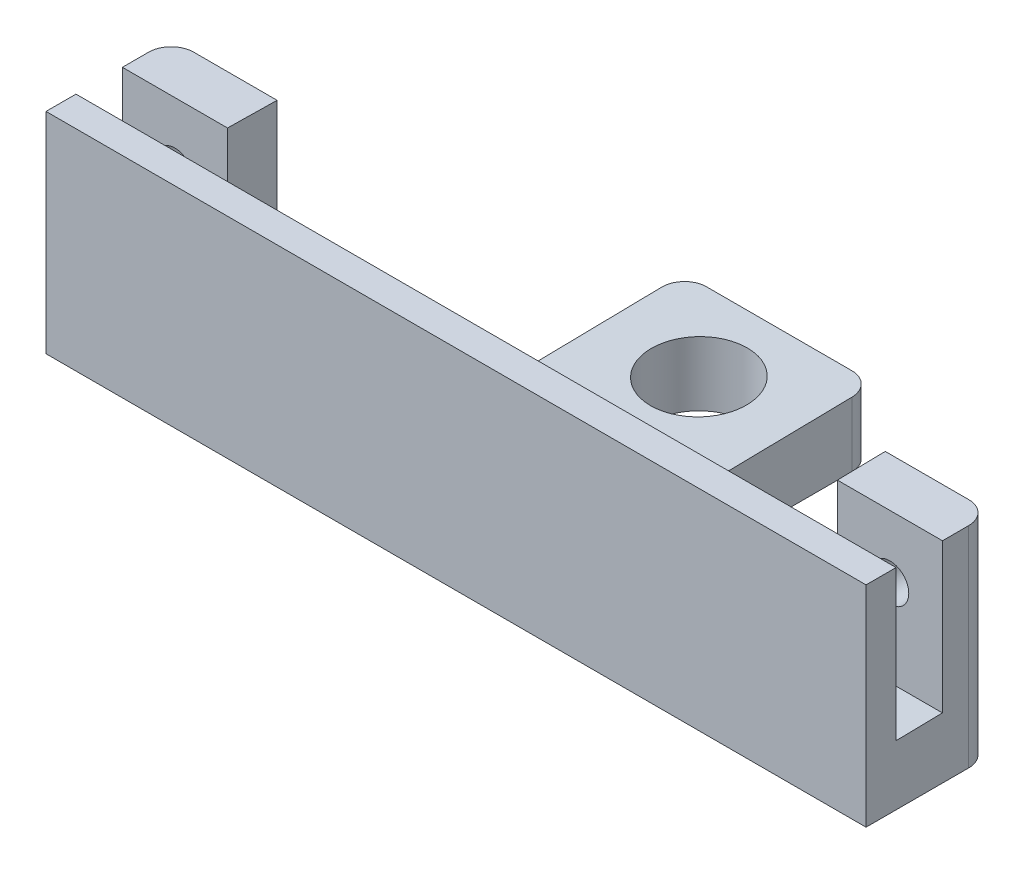
ISO-10303-21;
HEADER;
FILE_DESCRIPTION(('STEP AP214'),'2;1');
FILE_NAME('part.step','',(''),(''),'','','');
FILE_SCHEMA(('AUTOMOTIVE_DESIGN { 1 0 10303 214 1 1 1 1 }'));
ENDSEC;
DATA;
#1=APPLICATION_CONTEXT('core data for automotive mechanical design processes');
#2=APPLICATION_PROTOCOL_DEFINITION('international standard','automotive_design',2000,#1);
#3=PRODUCT_CONTEXT('',#1,'mechanical');
#4=PRODUCT('Part','Part','',(#3));
#5=PRODUCT_RELATED_PRODUCT_CATEGORY('part','',(#4));
#6=PRODUCT_DEFINITION_FORMATION('','',#4);
#7=PRODUCT_DEFINITION_CONTEXT('part definition',#1,'design');
#8=PRODUCT_DEFINITION('design','',#6,#7);
#9=PRODUCT_DEFINITION_SHAPE('','',#8);
#10=(LENGTH_UNIT() NAMED_UNIT(*) SI_UNIT(.MILLI.,.METRE.));
#11=(NAMED_UNIT(*) PLANE_ANGLE_UNIT() SI_UNIT($,.RADIAN.));
#12=(NAMED_UNIT(*) SI_UNIT($,.STERADIAN.) SOLID_ANGLE_UNIT());
#13=UNCERTAINTY_MEASURE_WITH_UNIT(LENGTH_MEASURE(1.E-05),#10,'distance_accuracy_value','');
#14=(GEOMETRIC_REPRESENTATION_CONTEXT(3) GLOBAL_UNCERTAINTY_ASSIGNED_CONTEXT((#13)) GLOBAL_UNIT_ASSIGNED_CONTEXT((#10,
#11,#12)) REPRESENTATION_CONTEXT('',''));
#15=CARTESIAN_POINT('',(0.,0.,0.));
#16=DIRECTION('',(0.,0.,1.));
#17=DIRECTION('',(1.,0.,0.));
#18=AXIS2_PLACEMENT_3D('',#15,#16,#17);
#19=CARTESIAN_POINT('',(14.0189,28.,-6.1944));
#20=DIRECTION('',(0.,0.,-1.));
#21=DIRECTION('',(-1.,0.,0.));
#22=AXIS2_PLACEMENT_3D('',#19,#20,#21);
#23=PLANE('',#22);
#24=CARTESIAN_POINT('',(6.9977,19.67,-6.1944));
#25=DIRECTION('',(0.,0.,1.));
#26=DIRECTION('',(1.,0.,0.));
#27=AXIS2_PLACEMENT_3D('',#24,#25,#26);
#28=CIRCLE('',#27,2.5019);
#29=CARTESIAN_POINT('',(9.4996,19.67,-6.1944));
#30=VERTEX_POINT('',#29);
#31=EDGE_CURVE('E272',#30,#30,#28,.T.);
#32=ORIENTED_EDGE('',*,*,#31,.F.);
#33=EDGE_LOOP('',(#32));
#34=FACE_BOUND('',#33,.T.);
#35=DIRECTION('',(1.,0.,0.));
#36=VECTOR('',#35,1.);
#37=CARTESIAN_POINT('',(0.,8.10812365419131,-6.1944));
#38=LINE('',#37,#36);
#39=CARTESIAN_POINT('',(0.,8.10812365419131,-6.1944));
#40=VERTEX_POINT('',#39);
#41=CARTESIAN_POINT('',(14.0189,8.10812365419131,-6.1944));
#42=VERTEX_POINT('',#41);
#43=EDGE_CURVE('E52',#40,#42,#38,.T.);
#44=ORIENTED_EDGE('',*,*,#43,.T.);
#45=DIRECTION('',(0.,-1.,0.));
#46=VECTOR('',#45,1.);
#47=CARTESIAN_POINT('',(14.0189,28.,-6.1944));
#48=LINE('',#47,#46);
#49=CARTESIAN_POINT('',(14.0189,28.,-6.1944));
#50=VERTEX_POINT('',#49);
#51=EDGE_CURVE('E313',#50,#42,#48,.T.);
#52=ORIENTED_EDGE('',*,*,#51,.F.);
#53=DIRECTION('',(1.,0.,0.));
#54=VECTOR('',#53,1.);
#55=CARTESIAN_POINT('',(14.0189,28.,-6.1944));
#56=LINE('',#55,#54);
#57=CARTESIAN_POINT('',(0.,28.,-6.1944));
#58=VERTEX_POINT('',#57);
#59=EDGE_CURVE('E306',#58,#50,#56,.T.);
#60=ORIENTED_EDGE('',*,*,#59,.F.);
#61=DIRECTION('',(0.,-1.,0.));
#62=VECTOR('',#61,1.);
#63=CARTESIAN_POINT('',(0.,28.,-6.1944));
#64=LINE('',#63,#62);
#65=EDGE_CURVE('E48',#58,#40,#64,.T.);
#66=ORIENTED_EDGE('',*,*,#65,.T.);
#67=EDGE_LOOP('',(#44,#52,#60,#66));
#68=FACE_BOUND('',#67,.T.);
#69=ADVANCED_FACE('F33',(#34,#68),#23,.F.);
#70=CARTESIAN_POINT('',(14.1324556703971,28.,-12.7));
#71=DIRECTION('',(-0.999847695156391,0.,-0.0174524064372938));
#72=DIRECTION('',(-0.0174524064372938,0.,0.999847695156391));
#73=AXIS2_PLACEMENT_3D('',#70,#71,#72);
#74=PLANE('',#73);
#75=DIRECTION('',(0.017449749160693,0.0174497491606759,-0.999695459881887));
#76=VECTOR('',#75,1.);
#77=CARTESIAN_POINT('',(14.0543499983098,8.14357365250105,-8.22532904297698));
#78=LINE('',#77,#76);
#79=CARTESIAN_POINT('',(14.1324556703971,8.22167932458828,-12.7));
#80=VERTEX_POINT('',#79);
#81=EDGE_CURVE('E220',#42,#80,#78,.T.);
#82=ORIENTED_EDGE('',*,*,#81,.T.);
#83=DIRECTION('',(0.,-1.,0.));
#84=VECTOR('',#83,1.);
#85=CARTESIAN_POINT('',(14.1324556703971,28.,-12.7));
#86=LINE('',#85,#84);
#87=CARTESIAN_POINT('',(14.1324556703971,28.,-12.7));
#88=VERTEX_POINT('',#87);
#89=EDGE_CURVE('E310',#88,#80,#86,.T.);
#90=ORIENTED_EDGE('',*,*,#89,.F.);
#91=DIRECTION('',(0.0174524064372938,0.,-0.999847695156391));
#92=VECTOR('',#91,1.);
#93=CARTESIAN_POINT('',(14.1324556703971,28.,-12.7));
#94=LINE('',#93,#92);
#95=EDGE_CURVE('E308',#50,#88,#94,.T.);
#96=ORIENTED_EDGE('',*,*,#95,.F.);
#97=ORIENTED_EDGE('',*,*,#51,.T.);
#98=EDGE_LOOP('',(#82,#90,#96,#97));
#99=FACE_BOUND('',#98,.T.);
#100=ADVANCED_FACE('F395',(#99),#74,.F.);
#101=CARTESIAN_POINT('',(95.3789,28.,-6.19440000000001));
#102=DIRECTION('',(0.,0.,-1.));
#103=DIRECTION('',(-1.,0.,0.));
#104=AXIS2_PLACEMENT_3D('',#101,#102,#103);
#105=PLANE('',#104);
#106=CARTESIAN_POINT('',(102.4001,19.67,-6.1944));
#107=DIRECTION('',(0.,0.,1.));
#108=DIRECTION('',(-1.,0.,0.));
#109=AXIS2_PLACEMENT_3D('',#106,#107,#108);
#110=CIRCLE('',#109,2.50190000000002);
#111=CARTESIAN_POINT('',(104.902,19.67,-6.1944));
#112=VERTEX_POINT('',#111);
#113=EDGE_CURVE('E271',#112,#112,#110,.T.);
#114=ORIENTED_EDGE('',*,*,#113,.F.);
#115=EDGE_LOOP('',(#114));
#116=FACE_BOUND('',#115,.T.);
#117=DIRECTION('',(1.,0.,0.));
#118=VECTOR('',#117,1.);
#119=CARTESIAN_POINT('',(95.3789,8.10812365419131,-6.19440000000001));
#120=LINE('',#119,#118);
#121=CARTESIAN_POINT('',(95.3789,8.10812365419131,-6.19440000000001));
#122=VERTEX_POINT('',#121);
#123=CARTESIAN_POINT('',(109.3978,8.10812365419131,-6.19440000000001));
#124=VERTEX_POINT('',#123);
#125=EDGE_CURVE('E211',#122,#124,#120,.T.);
#126=ORIENTED_EDGE('',*,*,#125,.T.);
#127=DIRECTION('',(0.,-1.,0.));
#128=VECTOR('',#127,1.);
#129=CARTESIAN_POINT('',(109.3978,28.,-6.19440000000001));
#130=LINE('',#129,#128);
#131=CARTESIAN_POINT('',(109.3978,28.,-6.19440000000001));
#132=VERTEX_POINT('',#131);
#133=EDGE_CURVE('E298',#132,#124,#130,.T.);
#134=ORIENTED_EDGE('',*,*,#133,.F.);
#135=DIRECTION('',(1.,0.,0.));
#136=VECTOR('',#135,1.);
#137=CARTESIAN_POINT('',(95.3789,28.,-6.19440000000001));
#138=LINE('',#137,#136);
#139=CARTESIAN_POINT('',(95.3789,28.,-6.19440000000001));
#140=VERTEX_POINT('',#139);
#141=EDGE_CURVE('E279',#140,#132,#138,.T.);
#142=ORIENTED_EDGE('',*,*,#141,.F.);
#143=DIRECTION('',(0.,-1.,0.));
#144=VECTOR('',#143,1.);
#145=CARTESIAN_POINT('',(95.3789,28.,-6.19440000000001));
#146=LINE('',#145,#144);
#147=EDGE_CURVE('E293',#140,#122,#146,.T.);
#148=ORIENTED_EDGE('',*,*,#147,.T.);
#149=EDGE_LOOP('',(#126,#134,#142,#148));
#150=FACE_BOUND('',#149,.T.);
#151=ADVANCED_FACE('F412',(#116,#150),#105,.F.);
#152=CARTESIAN_POINT('',(95.2653443296029,28.,-12.7));
#153=DIRECTION('',(0.999847695156391,0.,-0.0174524064372949));
#154=DIRECTION('',(-0.0174524064372949,0.,-0.999847695156391));
#155=AXIS2_PLACEMENT_3D('',#152,#153,#154);
#156=PLANE('',#155);
#157=DIRECTION('',(0.0174497491606962,-0.0174497491606759,0.999695459881887));
#158=VECTOR('',#157,1.);
#159=CARTESIAN_POINT('',(95.2299289082845,8.25709474590659,-14.7289481284645));
#160=LINE('',#159,#158);
#161=CARTESIAN_POINT('',(95.2653443296029,8.22167932458828,-12.7));
#162=VERTEX_POINT('',#161);
#163=EDGE_CURVE('E209',#162,#122,#160,.T.);
#164=ORIENTED_EDGE('',*,*,#163,.T.);
#165=ORIENTED_EDGE('',*,*,#147,.F.);
#166=DIRECTION('',(0.0174524064372949,0.,0.999847695156391));
#167=VECTOR('',#166,1.);
#168=CARTESIAN_POINT('',(95.2653443296029,28.,-12.7));
#169=LINE('',#168,#167);
#170=CARTESIAN_POINT('',(95.2653443296029,28.,-12.7));
#171=VERTEX_POINT('',#170);
#172=EDGE_CURVE('E291',#171,#140,#169,.T.);
#173=ORIENTED_EDGE('',*,*,#172,.F.);
#174=DIRECTION('',(0.,-1.,0.));
#175=VECTOR('',#174,1.);
#176=CARTESIAN_POINT('',(95.2653443296029,28.,-12.7));
#177=LINE('',#176,#175);
#178=EDGE_CURVE('E296',#171,#162,#177,.T.);
#179=ORIENTED_EDGE('',*,*,#178,.T.);
#180=EDGE_LOOP('',(#164,#165,#173,#179));
#181=FACE_BOUND('',#180,.T.);
#182=ADVANCED_FACE('F471',(#181),#156,.F.);
#183=CARTESIAN_POINT('',(67.3989,8.,-39.116));
#184=DIRECTION('',(-1.,0.,0.));
#185=DIRECTION('',(0.,0.,1.));
#186=AXIS2_PLACEMENT_3D('',#183,#184,#185);
#187=PLANE('',#186);
#188=DIRECTION('',(0.,-1.,0.));
#189=VECTOR('',#188,1.);
#190=CARTESIAN_POINT('',(67.3989,8.,-36.116));
#191=LINE('',#190,#189);
#192=CARTESIAN_POINT('',(67.3989,0.,-36.116));
#193=VERTEX_POINT('',#192);
#194=CARTESIAN_POINT('',(67.3989,8.63040712494726,-36.116));
#195=VERTEX_POINT('',#194);
#196=EDGE_CURVE('E205',#193,#195,#191,.F.);
#197=ORIENTED_EDGE('',*,*,#196,.T.);
#198=DIRECTION('',(0.,-0.0174524064372768,0.999847695156391));
#199=VECTOR('',#198,1.);
#200=CARTESIAN_POINT('',(67.3989,8.36180402307295,-20.7277385997116));
#201=LINE('',#200,#199);
#202=CARTESIAN_POINT('',(67.3989,8.32640971415756,-18.7));
#203=VERTEX_POINT('',#202);
#204=EDGE_CURVE('E197',#195,#203,#201,.T.);
#205=ORIENTED_EDGE('',*,*,#204,.T.);
#206=DIRECTION('',(0.,-1.,0.));
#207=VECTOR('',#206,1.);
#208=CARTESIAN_POINT('',(67.3989,0.,-18.7));
#209=LINE('',#208,#207);
#210=CARTESIAN_POINT('',(67.3989,0.,-18.7));
#211=VERTEX_POINT('',#210);
#212=EDGE_CURVE('E181',#203,#211,#209,.T.);
#213=ORIENTED_EDGE('',*,*,#212,.T.);
#214=DIRECTION('',(0.,0.,-1.));
#215=VECTOR('',#214,1.);
#216=CARTESIAN_POINT('',(67.3989,0.,-39.116));
#217=LINE('',#216,#215);
#218=EDGE_CURVE('E316',#211,#193,#217,.T.);
#219=ORIENTED_EDGE('',*,*,#218,.T.);
#220=EDGE_LOOP('',(#197,#205,#213,#219));
#221=FACE_BOUND('',#220,.T.);
#222=ADVANCED_FACE('F203',(#221),#187,.F.);
#223=CARTESIAN_POINT('',(41.9989,8.,-39.116));
#224=DIRECTION('',(0.,0.,1.));
#225=DIRECTION('',(1.,0.,0.));
#226=AXIS2_PLACEMENT_3D('',#223,#224,#225);
#227=PLANE('',#226);
#228=DIRECTION('',(-1.,0.,0.));
#229=VECTOR('',#228,1.);
#230=CARTESIAN_POINT('',(41.9989,0.,-39.116));
#231=LINE('',#230,#229);
#232=CARTESIAN_POINT('',(64.3989,0.,-39.116));
#233=VERTEX_POINT('',#232);
#234=CARTESIAN_POINT('',(44.9989,0.,-39.116));
#235=VERTEX_POINT('',#234);
#236=EDGE_CURVE('E323',#233,#235,#231,.T.);
#237=ORIENTED_EDGE('',*,*,#236,.T.);
#238=DIRECTION('',(0.,-1.,0.));
#239=VECTOR('',#238,1.);
#240=CARTESIAN_POINT('',(44.9989,8.,-39.116));
#241=LINE('',#240,#239);
#242=CARTESIAN_POINT('',(44.9989,8.6827723197319,-39.116));
#243=VERTEX_POINT('',#242);
#244=EDGE_CURVE('E367',#235,#243,#241,.F.);
#245=ORIENTED_EDGE('',*,*,#244,.T.);
#246=DIRECTION('',(1.,0.,0.));
#247=VECTOR('',#246,1.);
#248=CARTESIAN_POINT('',(64.3989,8.68277231973189,-39.116));
#249=LINE('',#248,#247);
#250=CARTESIAN_POINT('',(64.3989,8.68277231973189,-39.116));
#251=VERTEX_POINT('',#250);
#252=EDGE_CURVE('E234',#243,#251,#249,.T.);
#253=ORIENTED_EDGE('',*,*,#252,.T.);
#254=DIRECTION('',(0.,-1.,0.));
#255=VECTOR('',#254,1.);
#256=CARTESIAN_POINT('',(64.3989,8.,-39.116));
#257=LINE('',#256,#255);
#258=EDGE_CURVE('E364',#251,#233,#257,.T.);
#259=ORIENTED_EDGE('',*,*,#258,.T.);
#260=EDGE_LOOP('',(#237,#245,#253,#259));
#261=FACE_BOUND('',#260,.T.);
#262=ADVANCED_FACE('F427',(#261),#227,.F.);
#263=CARTESIAN_POINT('',(41.9989,8.,-39.116));
#264=DIRECTION('',(1.,0.,0.));
#265=DIRECTION('',(0.,0.,-1.));
#266=AXIS2_PLACEMENT_3D('',#263,#264,#265);
#267=PLANE('',#266);
#268=DIRECTION('',(0.,0.,1.));
#269=VECTOR('',#268,1.);
#270=CARTESIAN_POINT('',(41.9989,0.,-39.116));
#271=LINE('',#270,#269);
#272=CARTESIAN_POINT('',(41.9989,0.,-36.116));
#273=VERTEX_POINT('',#272);
#274=CARTESIAN_POINT('',(41.9989,0.,-18.7));
#275=VERTEX_POINT('',#274);
#276=EDGE_CURVE('E326',#273,#275,#271,.T.);
#277=ORIENTED_EDGE('',*,*,#276,.T.);
#278=DIRECTION('',(0.,-1.,0.));
#279=VECTOR('',#278,1.);
#280=CARTESIAN_POINT('',(41.9989,8.,-18.7));
#281=LINE('',#280,#279);
#282=CARTESIAN_POINT('',(41.9989,8.32640971415755,-18.7));
#283=VERTEX_POINT('',#282);
#284=EDGE_CURVE('E189',#275,#283,#281,.F.);
#285=ORIENTED_EDGE('',*,*,#284,.T.);
#286=DIRECTION('',(0.,0.0174524064372768,-0.999847695156391));
#287=VECTOR('',#286,1.);
#288=CARTESIAN_POINT('',(41.9989,8.66570884035821,-38.1384339213938));
#289=LINE('',#288,#287);
#290=CARTESIAN_POINT('',(41.9989,8.63040712494726,-36.116));
#291=VERTEX_POINT('',#290);
#292=EDGE_CURVE('E228',#283,#291,#289,.T.);
#293=ORIENTED_EDGE('',*,*,#292,.T.);
#294=DIRECTION('',(0.,-1.,0.));
#295=VECTOR('',#294,1.);
#296=CARTESIAN_POINT('',(41.9989,8.,-36.116));
#297=LINE('',#296,#295);
#298=EDGE_CURVE('E361',#291,#273,#297,.T.);
#299=ORIENTED_EDGE('',*,*,#298,.T.);
#300=EDGE_LOOP('',(#277,#285,#293,#299));
#301=FACE_BOUND('',#300,.T.);
#302=ADVANCED_FACE('F382',(#301),#267,.F.);
#303=CARTESIAN_POINT('',(0.,8.,-12.7));
#304=DIRECTION('',(0.,0.,1.));
#305=DIRECTION('',(1.,0.,0.));
#306=AXIS2_PLACEMENT_3D('',#303,#304,#305);
#307=PLANE('',#306);
#308=CARTESIAN_POINT('',(6.9977,19.67,-12.7));
#309=DIRECTION('',(0.,0.,1.));
#310=DIRECTION('',(1.,0.,0.));
#311=AXIS2_PLACEMENT_3D('',#308,#309,#310);
#312=CIRCLE('',#311,2.5019);
#313=CARTESIAN_POINT('',(9.4996,19.67,-12.7));
#314=VERTEX_POINT('',#313);
#315=EDGE_CURVE('E275',#314,#314,#312,.F.);
#316=ORIENTED_EDGE('',*,*,#315,.F.);
#317=EDGE_LOOP('',(#316));
#318=FACE_BOUND('',#317,.T.);
#319=DIRECTION('',(1.,0.,0.));
#320=VECTOR('',#319,1.);
#321=CARTESIAN_POINT('',(35.9989,8.22167932458827,-12.7));
#322=LINE('',#321,#320);
#323=CARTESIAN_POINT('',(35.9989,8.22167932458827,-12.7));
#324=VERTEX_POINT('',#323);
#325=EDGE_CURVE('E222',#80,#324,#322,.T.);
#326=ORIENTED_EDGE('',*,*,#325,.T.);
#327=DIRECTION('',(0.,-1.,0.));
#328=VECTOR('',#327,1.);
#329=CARTESIAN_POINT('',(35.9989,0.,-12.7));
#330=LINE('',#329,#328);
#331=CARTESIAN_POINT('',(35.9989,0.,-12.7));
#332=VERTEX_POINT('',#331);
#333=EDGE_CURVE('E370',#324,#332,#330,.T.);
#334=ORIENTED_EDGE('',*,*,#333,.T.);
#335=DIRECTION('',(-1.,0.,0.));
#336=VECTOR('',#335,1.);
#337=CARTESIAN_POINT('',(0.,0.,-12.7));
#338=LINE('',#337,#336);
#339=CARTESIAN_POINT('',(3.,0.,-12.7));
#340=VERTEX_POINT('',#339);
#341=EDGE_CURVE('E329',#332,#340,#338,.T.);
#342=ORIENTED_EDGE('',*,*,#341,.T.);
#343=DIRECTION('',(0.,-1.,0.));
#344=VECTOR('',#343,1.);
#345=CARTESIAN_POINT('',(3.,8.,-12.7));
#346=LINE('',#345,#344);
#347=CARTESIAN_POINT('',(3.,28.,-12.7));
#348=VERTEX_POINT('',#347);
#349=EDGE_CURVE('E350',#340,#348,#346,.F.);
#350=ORIENTED_EDGE('',*,*,#349,.T.);
#351=DIRECTION('',(-1.,0.,0.));
#352=VECTOR('',#351,1.);
#353=CARTESIAN_POINT('',(0.,28.,-12.7));
#354=LINE('',#353,#352);
#355=EDGE_CURVE('E301',#88,#348,#354,.T.);
#356=ORIENTED_EDGE('',*,*,#355,.F.);
#357=ORIENTED_EDGE('',*,*,#89,.T.);
#358=EDGE_LOOP('',(#326,#334,#342,#350,#356,#357));
#359=FACE_BOUND('',#358,.T.);
#360=ADVANCED_FACE('F390',(#318,#359),#307,.F.);
#361=CARTESIAN_POINT('',(0.,8.,0.));
#362=DIRECTION('',(1.,0.,0.));
#363=DIRECTION('',(0.,0.,-1.));
#364=AXIS2_PLACEMENT_3D('',#361,#362,#363);
#365=PLANE('',#364);
#366=DIRECTION('',(0.,-1.,0.));
#367=VECTOR('',#366,1.);
#368=CARTESIAN_POINT('',(0.,137.470903188199,0.));
#369=LINE('',#368,#367);
#370=CARTESIAN_POINT('',(0.,28.,0.));
#371=VERTEX_POINT('',#370);
#372=CARTESIAN_POINT('',(0.,8.00000000000001,0.));
#373=VERTEX_POINT('',#372);
#374=EDGE_CURVE('E257',#371,#373,#369,.T.);
#375=ORIENTED_EDGE('',*,*,#374,.T.);
#376=DIRECTION('',(0.,0.0174524064372768,-0.999847695156391));
#377=VECTOR('',#376,1.);
#378=CARTESIAN_POINT('',(0.,8.03549372890468,-2.03343436708299));
#379=LINE('',#378,#377);
#380=EDGE_CURVE('E216',#373,#40,#379,.T.);
#381=ORIENTED_EDGE('',*,*,#380,.T.);
#382=ORIENTED_EDGE('',*,*,#65,.F.);
#383=DIRECTION('',(0.,0.,1.));
#384=VECTOR('',#383,1.);
#385=CARTESIAN_POINT('',(0.,28.,-6.1944));
#386=LINE('',#385,#384);
#387=CARTESIAN_POINT('',(0.,28.,-9.7));
#388=VERTEX_POINT('',#387);
#389=EDGE_CURVE('E304',#388,#58,#386,.T.);
#390=ORIENTED_EDGE('',*,*,#389,.F.);
#391=DIRECTION('',(0.,-1.,0.));
#392=VECTOR('',#391,1.);
#393=CARTESIAN_POINT('',(0.,8.,-9.7));
#394=LINE('',#393,#392);
#395=CARTESIAN_POINT('',(0.,0.,-9.7));
#396=VERTEX_POINT('',#395);
#397=EDGE_CURVE('E320',#388,#396,#394,.T.);
#398=ORIENTED_EDGE('',*,*,#397,.T.);
#399=DIRECTION('',(0.,0.,1.));
#400=VECTOR('',#399,1.);
#401=CARTESIAN_POINT('',(0.,0.,0.));
#402=LINE('',#401,#400);
#403=CARTESIAN_POINT('',(0.,0.,3.99999999999999));
#404=VERTEX_POINT('',#403);
#405=EDGE_CURVE('E331',#396,#404,#402,.T.);
#406=ORIENTED_EDGE('',*,*,#405,.T.);
#407=DIRECTION('',(0.,-1.,0.));
#408=VECTOR('',#407,1.);
#409=CARTESIAN_POINT('',(0.,137.470903188199,3.99999999999999));
#410=LINE('',#409,#408);
#411=CARTESIAN_POINT('',(0.,28.,3.99999999999999));
#412=VERTEX_POINT('',#411);
#413=EDGE_CURVE('E248',#412,#404,#410,.T.);
#414=ORIENTED_EDGE('',*,*,#413,.F.);
#415=DIRECTION('',(0.,0.,-1.));
#416=VECTOR('',#415,1.);
#417=CARTESIAN_POINT('',(0.,28.,0.));
#418=LINE('',#417,#416);
#419=EDGE_CURVE('E258',#412,#371,#418,.T.);
#420=ORIENTED_EDGE('',*,*,#419,.T.);
#421=EDGE_LOOP('',(#375,#381,#382,#390,#398,#406,#414,#420));
#422=FACE_BOUND('',#421,.T.);
#423=ADVANCED_FACE('F398',(#422),#365,.F.);
#424=CARTESIAN_POINT('',(109.3978,8.,0.));
#425=DIRECTION('',(-1.,0.,0.));
#426=DIRECTION('',(0.,0.,1.));
#427=AXIS2_PLACEMENT_3D('',#424,#425,#426);
#428=PLANE('',#427);
#429=DIRECTION('',(0.,0.,-1.));
#430=VECTOR('',#429,1.);
#431=CARTESIAN_POINT('',(109.3978,0.,0.));
#432=LINE('',#431,#430);
#433=CARTESIAN_POINT('',(109.3978,0.,3.99999999999999));
#434=VERTEX_POINT('',#433);
#435=CARTESIAN_POINT('',(109.3978,0.,-9.70000000000002));
#436=VERTEX_POINT('',#435);
#437=EDGE_CURVE('E333',#434,#436,#432,.T.);
#438=ORIENTED_EDGE('',*,*,#437,.T.);
#439=DIRECTION('',(0.,-1.,0.));
#440=VECTOR('',#439,1.);
#441=CARTESIAN_POINT('',(109.3978,8.,-9.70000000000002));
#442=LINE('',#441,#440);
#443=CARTESIAN_POINT('',(109.3978,28.,-9.70000000000002));
#444=VERTEX_POINT('',#443);
#445=EDGE_CURVE('E357',#436,#444,#442,.F.);
#446=ORIENTED_EDGE('',*,*,#445,.T.);
#447=DIRECTION('',(0.,0.,-1.));
#448=VECTOR('',#447,1.);
#449=CARTESIAN_POINT('',(109.3978,28.,-6.19440000000001));
#450=LINE('',#449,#448);
#451=EDGE_CURVE('E286',#132,#444,#450,.T.);
#452=ORIENTED_EDGE('',*,*,#451,.F.);
#453=ORIENTED_EDGE('',*,*,#133,.T.);
#454=DIRECTION('',(0.,-0.0174524064372768,0.999847695156391));
#455=VECTOR('',#454,1.);
#456=CARTESIAN_POINT('',(109.3978,8.14358445009163,-8.22594763652655));
#457=LINE('',#456,#455);
#458=CARTESIAN_POINT('',(109.3978,7.99999999999999,0.));
#459=VERTEX_POINT('',#458);
#460=EDGE_CURVE('E213',#124,#459,#457,.T.);
#461=ORIENTED_EDGE('',*,*,#460,.T.);
#462=DIRECTION('',(0.,-1.,0.));
#463=VECTOR('',#462,1.);
#464=CARTESIAN_POINT('',(109.3978,137.470903188199,0.));
#465=LINE('',#464,#463);
#466=CARTESIAN_POINT('',(109.3978,28.,0.));
#467=VERTEX_POINT('',#466);
#468=EDGE_CURVE('E253',#467,#459,#465,.T.);
#469=ORIENTED_EDGE('',*,*,#468,.F.);
#470=DIRECTION('',(0.,0.,1.));
#471=VECTOR('',#470,1.);
#472=CARTESIAN_POINT('',(109.3978,28.,0.));
#473=LINE('',#472,#471);
#474=CARTESIAN_POINT('',(109.3978,28.,3.99999999999999));
#475=VERTEX_POINT('',#474);
#476=EDGE_CURVE('E249',#467,#475,#473,.T.);
#477=ORIENTED_EDGE('',*,*,#476,.T.);
#478=DIRECTION('',(0.,-1.,0.));
#479=VECTOR('',#478,1.);
#480=CARTESIAN_POINT('',(109.3978,137.470903188199,3.99999999999999));
#481=LINE('',#480,#479);
#482=EDGE_CURVE('E252',#475,#434,#481,.T.);
#483=ORIENTED_EDGE('',*,*,#482,.T.);
#484=EDGE_LOOP('',(#438,#446,#452,#453,#461,#469,#477,#483));
#485=FACE_BOUND('',#484,.T.);
#486=ADVANCED_FACE('F408',(#485),#428,.F.);
#487=CARTESIAN_POINT('',(109.3978,8.,-12.7));
#488=DIRECTION('',(0.,0.,1.));
#489=DIRECTION('',(1.,0.,0.));
#490=AXIS2_PLACEMENT_3D('',#487,#488,#489);
#491=PLANE('',#490);
#492=DIRECTION('',(0.,-1.,0.));
#493=VECTOR('',#492,1.);
#494=CARTESIAN_POINT('',(73.3989,8.,-12.7));
#495=LINE('',#494,#493);
#496=CARTESIAN_POINT('',(73.3989,0.,-12.7));
#497=VERTEX_POINT('',#496);
#498=CARTESIAN_POINT('',(73.3989,8.22167932458828,-12.7));
#499=VERTEX_POINT('',#498);
#500=EDGE_CURVE('E188',#497,#499,#495,.F.);
#501=ORIENTED_EDGE('',*,*,#500,.T.);
#502=DIRECTION('',(1.,0.,0.));
#503=VECTOR('',#502,1.);
#504=CARTESIAN_POINT('',(95.2653443296029,8.22167932458827,-12.7));
#505=LINE('',#504,#503);
#506=EDGE_CURVE('E201',#499,#162,#505,.T.);
#507=ORIENTED_EDGE('',*,*,#506,.T.);
#508=ORIENTED_EDGE('',*,*,#178,.F.);
#509=DIRECTION('',(-1.,0.,0.));
#510=VECTOR('',#509,1.);
#511=CARTESIAN_POINT('',(109.3978,28.,-12.7));
#512=LINE('',#511,#510);
#513=CARTESIAN_POINT('',(106.3978,28.,-12.7));
#514=VERTEX_POINT('',#513);
#515=EDGE_CURVE('E289',#514,#171,#512,.T.);
#516=ORIENTED_EDGE('',*,*,#515,.F.);
#517=DIRECTION('',(0.,-1.,0.));
#518=VECTOR('',#517,1.);
#519=CARTESIAN_POINT('',(106.3978,8.,-12.7));
#520=LINE('',#519,#518);
#521=CARTESIAN_POINT('',(106.3978,0.,-12.7));
#522=VERTEX_POINT('',#521);
#523=EDGE_CURVE('E354',#514,#522,#520,.T.);
#524=ORIENTED_EDGE('',*,*,#523,.T.);
#525=DIRECTION('',(-1.,0.,0.));
#526=VECTOR('',#525,1.);
#527=CARTESIAN_POINT('',(109.3978,0.,-12.7));
#528=LINE('',#527,#526);
#529=EDGE_CURVE('E321',#522,#497,#528,.T.);
#530=ORIENTED_EDGE('',*,*,#529,.T.);
#531=EDGE_LOOP('',(#501,#507,#508,#516,#524,#530));
#532=FACE_BOUND('',#531,.T.);
#533=CARTESIAN_POINT('',(102.4001,19.67,-12.7));
#534=DIRECTION('',(0.,0.,1.));
#535=DIRECTION('',(1.,0.,0.));
#536=AXIS2_PLACEMENT_3D('',#533,#534,#535);
#537=CIRCLE('',#536,2.50190000000002);
#538=CARTESIAN_POINT('',(104.902,19.67,-12.7));
#539=VERTEX_POINT('',#538);
#540=EDGE_CURVE('E276',#539,#539,#537,.F.);
#541=ORIENTED_EDGE('',*,*,#540,.F.);
#542=EDGE_LOOP('',(#541));
#543=FACE_BOUND('',#542,.T.);
#544=ADVANCED_FACE('F417',(#532,#543),#491,.F.);
#545=CARTESIAN_POINT('',(0.,0.,0.));
#546=DIRECTION('',(0.,-1.,0.));
#547=DIRECTION('',(0.,0.,-1.));
#548=AXIS2_PLACEMENT_3D('',#545,#546,#547);
#549=PLANE('',#548);
#550=CARTESIAN_POINT('',(54.6989,0.,-28.3972));
#551=DIRECTION('',(0.,-1.,0.));
#552=DIRECTION('',(0.,0.,-1.));
#553=AXIS2_PLACEMENT_3D('',#550,#551,#552);
#554=CIRCLE('',#553,6.45);
#555=CARTESIAN_POINT('',(54.6989,0.,-34.8472));
#556=VERTEX_POINT('',#555);
#557=EDGE_CURVE('E268',#556,#556,#554,.F.);
#558=ORIENTED_EDGE('',*,*,#557,.T.);
#559=EDGE_LOOP('',(#558));
#560=FACE_BOUND('',#559,.T.);
#561=ORIENTED_EDGE('',*,*,#405,.F.);
#562=CARTESIAN_POINT('',(3.,0.,-9.7));
#563=DIRECTION('',(0.,-1.,0.));
#564=DIRECTION('',(0.,0.,-1.));
#565=AXIS2_PLACEMENT_3D('',#562,#563,#564);
#566=CIRCLE('',#565,3.);
#567=EDGE_CURVE('E347',#396,#340,#566,.T.);
#568=ORIENTED_EDGE('',*,*,#567,.T.);
#569=ORIENTED_EDGE('',*,*,#341,.F.);
#570=CARTESIAN_POINT('',(35.9989,0.,-18.7));
#571=DIRECTION('',(0.,-1.,0.));
#572=DIRECTION('',(0.,0.,-1.));
#573=AXIS2_PLACEMENT_3D('',#570,#571,#572);
#574=CIRCLE('',#573,6.);
#575=EDGE_CURVE('E41',#332,#275,#574,.F.);
#576=ORIENTED_EDGE('',*,*,#575,.T.);
#577=ORIENTED_EDGE('',*,*,#276,.F.);
#578=CARTESIAN_POINT('',(44.9989,0.,-36.116));
#579=DIRECTION('',(0.,-1.,0.));
#580=DIRECTION('',(0.,0.,-1.));
#581=AXIS2_PLACEMENT_3D('',#578,#579,#580);
#582=CIRCLE('',#581,3.);
#583=EDGE_CURVE('E343',#273,#235,#582,.T.);
#584=ORIENTED_EDGE('',*,*,#583,.T.);
#585=ORIENTED_EDGE('',*,*,#236,.F.);
#586=CARTESIAN_POINT('',(64.3989,0.,-36.116));
#587=DIRECTION('',(0.,-1.,0.));
#588=DIRECTION('',(0.,0.,-1.));
#589=AXIS2_PLACEMENT_3D('',#586,#587,#588);
#590=CIRCLE('',#589,3.);
#591=EDGE_CURVE('E340',#233,#193,#590,.T.);
#592=ORIENTED_EDGE('',*,*,#591,.T.);
#593=ORIENTED_EDGE('',*,*,#218,.F.);
#594=CARTESIAN_POINT('',(73.3989,0.,-18.7));
#595=DIRECTION('',(0.,-1.,0.));
#596=DIRECTION('',(0.,0.,-1.));
#597=AXIS2_PLACEMENT_3D('',#594,#595,#596);
#598=CIRCLE('',#597,6.);
#599=EDGE_CURVE('E11',#211,#497,#598,.F.);
#600=ORIENTED_EDGE('',*,*,#599,.T.);
#601=ORIENTED_EDGE('',*,*,#529,.F.);
#602=CARTESIAN_POINT('',(106.3978,0.,-9.70000000000002));
#603=DIRECTION('',(0.,-1.,0.));
#604=DIRECTION('',(0.,0.,-1.));
#605=AXIS2_PLACEMENT_3D('',#602,#603,#604);
#606=CIRCLE('',#605,3.);
#607=EDGE_CURVE('E345',#522,#436,#606,.T.);
#608=ORIENTED_EDGE('',*,*,#607,.T.);
#609=ORIENTED_EDGE('',*,*,#437,.F.);
#610=DIRECTION('',(-1.,0.,0.));
#611=VECTOR('',#610,1.);
#612=CARTESIAN_POINT('',(109.3978,0.,3.99999999999999));
#613=LINE('',#612,#611);
#614=EDGE_CURVE('E242',#434,#404,#613,.T.);
#615=ORIENTED_EDGE('',*,*,#614,.T.);
#616=EDGE_LOOP('',(#561,#568,#569,#576,#577,#584,#585,#592,#593,#600,#601,#608,#609,#615));
#617=FACE_BOUND('',#616,.T.);
#618=ADVANCED_FACE('F378',(#560,#617),#549,.T.);
#619=CARTESIAN_POINT('',(0.,28.,0.));
#620=DIRECTION('',(0.,1.,0.));
#621=DIRECTION('',(0.,0.,1.));
#622=AXIS2_PLACEMENT_3D('',#619,#620,#621);
#623=PLANE('',#622);
#624=ORIENTED_EDGE('',*,*,#355,.T.);
#625=CARTESIAN_POINT('',(3.,28.,-9.7));
#626=DIRECTION('',(0.,1.,0.));
#627=DIRECTION('',(0.,0.,1.));
#628=AXIS2_PLACEMENT_3D('',#625,#626,#627);
#629=CIRCLE('',#628,3.);
#630=EDGE_CURVE('E352',#348,#388,#629,.T.);
#631=ORIENTED_EDGE('',*,*,#630,.T.);
#632=ORIENTED_EDGE('',*,*,#389,.T.);
#633=ORIENTED_EDGE('',*,*,#59,.T.);
#634=ORIENTED_EDGE('',*,*,#95,.T.);
#635=EDGE_LOOP('',(#624,#631,#632,#633,#634));
#636=FACE_BOUND('',#635,.T.);
#637=ADVANCED_FACE('F454',(#636),#623,.T.);
#638=CARTESIAN_POINT('',(0.,28.,0.));
#639=DIRECTION('',(0.,1.,0.));
#640=DIRECTION('',(0.,0.,1.));
#641=AXIS2_PLACEMENT_3D('',#638,#639,#640);
#642=PLANE('',#641);
#643=ORIENTED_EDGE('',*,*,#451,.T.);
#644=CARTESIAN_POINT('',(106.3978,28.,-9.70000000000002));
#645=DIRECTION('',(0.,1.,0.));
#646=DIRECTION('',(0.,0.,1.));
#647=AXIS2_PLACEMENT_3D('',#644,#645,#646);
#648=CIRCLE('',#647,3.);
#649=EDGE_CURVE('E359',#444,#514,#648,.T.);
#650=ORIENTED_EDGE('',*,*,#649,.T.);
#651=ORIENTED_EDGE('',*,*,#515,.T.);
#652=ORIENTED_EDGE('',*,*,#172,.T.);
#653=ORIENTED_EDGE('',*,*,#141,.T.);
#654=EDGE_LOOP('',(#643,#650,#651,#652,#653));
#655=FACE_BOUND('',#654,.T.);
#656=ADVANCED_FACE('F494',(#655),#642,.T.);
#657=CARTESIAN_POINT('',(102.4001,19.67,-39.117));
#658=DIRECTION('',(0.,0.,1.));
#659=DIRECTION('',(1.,0.,0.));
#660=AXIS2_PLACEMENT_3D('',#657,#658,#659);
#661=CYLINDRICAL_SURFACE('',#660,2.50190000000002);
#662=CARTESIAN_POINT('',(104.902,19.67,-6.1944));
#663=CARTESIAN_POINT('',(104.902,19.67,-6.26216666666667));
#664=CARTESIAN_POINT('',(104.902,19.67,-6.32993333333334));
#665=CARTESIAN_POINT('',(104.902,19.67,-6.46546666666667));
#666=CARTESIAN_POINT('',(104.902,19.67,-6.53323333333334));
#667=CARTESIAN_POINT('',(104.902,19.67,-6.66876666666667));
#668=CARTESIAN_POINT('',(104.902,19.67,-6.73653333333334));
#669=CARTESIAN_POINT('',(104.902,19.67,-6.87206666666667));
#670=CARTESIAN_POINT('',(104.902,19.67,-6.93983333333334));
#671=CARTESIAN_POINT('',(104.902,19.67,-7.07536666666667));
#672=CARTESIAN_POINT('',(104.902,19.67,-7.14313333333334));
#673=CARTESIAN_POINT('',(104.902,19.67,-7.27866666666667));
#674=CARTESIAN_POINT('',(104.902,19.67,-7.34643333333334));
#675=CARTESIAN_POINT('',(104.902,19.67,-7.48196666666668));
#676=CARTESIAN_POINT('',(104.902,19.67,-7.54973333333334));
#677=CARTESIAN_POINT('',(104.902,19.67,-7.68526666666667));
#678=CARTESIAN_POINT('',(104.902,19.67,-7.75303333333334));
#679=CARTESIAN_POINT('',(104.902,19.67,-7.88856666666667));
#680=CARTESIAN_POINT('',(104.902,19.67,-7.95633333333334));
#681=CARTESIAN_POINT('',(104.902,19.67,-8.09186666666667));
#682=CARTESIAN_POINT('',(104.902,19.67,-8.15963333333334));
#683=CARTESIAN_POINT('',(104.902,19.67,-8.29516666666667));
#684=CARTESIAN_POINT('',(104.902,19.67,-8.36293333333334));
#685=CARTESIAN_POINT('',(104.902,19.67,-8.49846666666667));
#686=CARTESIAN_POINT('',(104.902,19.67,-8.56623333333334));
#687=CARTESIAN_POINT('',(104.902,19.67,-8.70176666666667));
#688=CARTESIAN_POINT('',(104.902,19.67,-8.76953333333334));
#689=CARTESIAN_POINT('',(104.902,19.67,-8.90506666666668));
#690=CARTESIAN_POINT('',(104.902,19.67,-8.97283333333334));
#691=CARTESIAN_POINT('',(104.902,19.67,-9.10836666666668));
#692=CARTESIAN_POINT('',(104.902,19.67,-9.17613333333334));
#693=CARTESIAN_POINT('',(104.902,19.67,-9.31166666666668));
#694=CARTESIAN_POINT('',(104.902,19.67,-9.37943333333334));
#695=CARTESIAN_POINT('',(104.902,19.67,-9.51496666666668));
#696=CARTESIAN_POINT('',(104.902,19.67,-9.58273333333334));
#697=CARTESIAN_POINT('',(104.902,19.67,-9.71826666666668));
#698=CARTESIAN_POINT('',(104.902,19.67,-9.78603333333334));
#699=CARTESIAN_POINT('',(104.902,19.67,-9.92156666666668));
#700=CARTESIAN_POINT('',(104.902,19.67,-9.98933333333334));
#701=CARTESIAN_POINT('',(104.902,19.67,-10.1248666666667));
#702=CARTESIAN_POINT('',(104.902,19.67,-10.1926333333333));
#703=CARTESIAN_POINT('',(104.902,19.67,-10.3281666666667));
#704=CARTESIAN_POINT('',(104.902,19.67,-10.3959333333333));
#705=CARTESIAN_POINT('',(104.902,19.67,-10.5314666666667));
#706=CARTESIAN_POINT('',(104.902,19.67,-10.5992333333333));
#707=CARTESIAN_POINT('',(104.902,19.67,-10.7347666666667));
#708=CARTESIAN_POINT('',(104.902,19.67,-10.8025333333333));
#709=CARTESIAN_POINT('',(104.902,19.67,-10.9380666666667));
#710=CARTESIAN_POINT('',(104.902,19.67,-11.0058333333333));
#711=CARTESIAN_POINT('',(104.902,19.67,-11.1413666666667));
#712=CARTESIAN_POINT('',(104.902,19.67,-11.2091333333333));
#713=CARTESIAN_POINT('',(104.902,19.67,-11.3446666666667));
#714=CARTESIAN_POINT('',(104.902,19.67,-11.4124333333334));
#715=CARTESIAN_POINT('',(104.902,19.67,-11.5479666666667));
#716=CARTESIAN_POINT('',(104.902,19.67,-11.6157333333334));
#717=CARTESIAN_POINT('',(104.902,19.67,-11.7512666666667));
#718=CARTESIAN_POINT('',(104.902,19.67,-11.8190333333333));
#719=CARTESIAN_POINT('',(104.902,19.67,-11.9545666666667));
#720=CARTESIAN_POINT('',(104.902,19.67,-12.0223333333333));
#721=CARTESIAN_POINT('',(104.902,19.67,-12.1578666666667));
#722=CARTESIAN_POINT('',(104.902,19.67,-12.2256333333334));
#723=CARTESIAN_POINT('',(104.902,19.67,-12.3611666666667));
#724=CARTESIAN_POINT('',(104.902,19.67,-12.4289333333334));
#725=CARTESIAN_POINT('',(104.902,19.67,-12.5644666666667));
#726=CARTESIAN_POINT('',(104.902,19.67,-12.6322333333334));
#727=CARTESIAN_POINT('',(104.902,19.67,-12.7));
#728=B_SPLINE_CURVE_WITH_KNOTS('',3,(#662,#663,#664,#665,#666,#667,#668,#669,#670,#671,#672,
#673,#674,#675,#676,#677,#678,#679,#680,#681,#682,#683,#684,#685,#686,#687,#688,#689,#690,#691,
#692,#693,#694,#695,#696,#697,#698,#699,#700,#701,#702,#703,#704,#705,#706,#707,#708,#709,#710,
#711,#712,#713,#714,#715,#716,#717,#718,#719,#720,#721,#722,#723,#724,#725,#726,#727),
.UNSPECIFIED.,.F.,.F.,(4,2,2,2,2,2,2,2,2,2,2,2,2,2,2,2,2,2,2,2,2,2,2,2,2,2,2,2,2,2,2,2,4),(0.,
0.203300000000003,0.4066,0.609900000000003,0.8132,1.0165,1.21980000000001,1.4231,
1.62640000000001,1.8297,2.033,2.2363,2.4396,2.64290000000001,2.84620000000001,3.04950000000001,
3.25280000000001,3.45610000000001,3.65940000000001,3.86270000000001,4.06600000000001,
4.26930000000001,4.47260000000001,4.67590000000001,4.87920000000001,5.08250000000001,
5.28580000000001,5.48910000000001,5.69240000000001,5.89570000000001,6.09900000000002,
6.30230000000002,6.50560000000002),.UNSPECIFIED.);
#729=EDGE_CURVE('BSEAM508',#112,#539,#728,.T.);
#730=ORIENTED_EDGE('',*,*,#113,.T.);
#731=ORIENTED_EDGE('',*,*,#540,.T.);
#732=ORIENTED_EDGE('',*,*,#729,.T.);
#733=ORIENTED_EDGE('',*,*,#729,.F.);
#734=EDGE_LOOP('',(#730,#732,#731,#733));
#735=FACE_BOUND('',#734,.T.);
#736=ADVANCED_FACE('F508',(#735),#661,.F.);
#737=CARTESIAN_POINT('',(6.9977,19.67,-39.117));
#738=DIRECTION('',(0.,0.,1.));
#739=DIRECTION('',(1.,0.,0.));
#740=AXIS2_PLACEMENT_3D('',#737,#738,#739);
#741=CYLINDRICAL_SURFACE('',#740,2.5019);
#742=CARTESIAN_POINT('',(9.4996,19.67,-6.1944));
#743=CARTESIAN_POINT('',(9.4996,19.67,-6.26216666666667));
#744=CARTESIAN_POINT('',(9.4996,19.67,-6.32993333333334));
#745=CARTESIAN_POINT('',(9.4996,19.67,-6.46546666666667));
#746=CARTESIAN_POINT('',(9.4996,19.67,-6.53323333333334));
#747=CARTESIAN_POINT('',(9.4996,19.67,-6.66876666666667));
#748=CARTESIAN_POINT('',(9.4996,19.67,-6.73653333333333));
#749=CARTESIAN_POINT('',(9.4996,19.67,-6.87206666666667));
#750=CARTESIAN_POINT('',(9.4996,19.67,-6.93983333333334));
#751=CARTESIAN_POINT('',(9.4996,19.67,-7.07536666666667));
#752=CARTESIAN_POINT('',(9.4996,19.67,-7.14313333333334));
#753=CARTESIAN_POINT('',(9.4996,19.67,-7.27866666666667));
#754=CARTESIAN_POINT('',(9.4996,19.67,-7.34643333333334));
#755=CARTESIAN_POINT('',(9.4996,19.67,-7.48196666666667));
#756=CARTESIAN_POINT('',(9.4996,19.67,-7.54973333333333));
#757=CARTESIAN_POINT('',(9.4996,19.67,-7.68526666666667));
#758=CARTESIAN_POINT('',(9.4996,19.67,-7.75303333333334));
#759=CARTESIAN_POINT('',(9.4996,19.67,-7.88856666666667));
#760=CARTESIAN_POINT('',(9.4996,19.67,-7.95633333333333));
#761=CARTESIAN_POINT('',(9.4996,19.67,-8.09186666666667));
#762=CARTESIAN_POINT('',(9.4996,19.67,-8.15963333333333));
#763=CARTESIAN_POINT('',(9.4996,19.67,-8.29516666666667));
#764=CARTESIAN_POINT('',(9.4996,19.67,-8.36293333333333));
#765=CARTESIAN_POINT('',(9.4996,19.67,-8.49846666666667));
#766=CARTESIAN_POINT('',(9.4996,19.67,-8.56623333333333));
#767=CARTESIAN_POINT('',(9.4996,19.67,-8.70176666666667));
#768=CARTESIAN_POINT('',(9.4996,19.67,-8.76953333333333));
#769=CARTESIAN_POINT('',(9.4996,19.67,-8.90506666666667));
#770=CARTESIAN_POINT('',(9.4996,19.67,-8.97283333333333));
#771=CARTESIAN_POINT('',(9.4996,19.67,-9.10836666666667));
#772=CARTESIAN_POINT('',(9.4996,19.67,-9.17613333333333));
#773=CARTESIAN_POINT('',(9.4996,19.67,-9.31166666666667));
#774=CARTESIAN_POINT('',(9.4996,19.67,-9.37943333333333));
#775=CARTESIAN_POINT('',(9.4996,19.67,-9.51496666666667));
#776=CARTESIAN_POINT('',(9.4996,19.67,-9.58273333333333));
#777=CARTESIAN_POINT('',(9.4996,19.67,-9.71826666666667));
#778=CARTESIAN_POINT('',(9.4996,19.67,-9.78603333333333));
#779=CARTESIAN_POINT('',(9.4996,19.67,-9.92156666666667));
#780=CARTESIAN_POINT('',(9.4996,19.67,-9.98933333333333));
#781=CARTESIAN_POINT('',(9.4996,19.67,-10.1248666666667));
#782=CARTESIAN_POINT('',(9.4996,19.67,-10.1926333333333));
#783=CARTESIAN_POINT('',(9.4996,19.67,-10.3281666666667));
#784=CARTESIAN_POINT('',(9.4996,19.67,-10.3959333333333));
#785=CARTESIAN_POINT('',(9.4996,19.67,-10.5314666666667));
#786=CARTESIAN_POINT('',(9.4996,19.67,-10.5992333333333));
#787=CARTESIAN_POINT('',(9.4996,19.67,-10.7347666666667));
#788=CARTESIAN_POINT('',(9.4996,19.67,-10.8025333333333));
#789=CARTESIAN_POINT('',(9.4996,19.67,-10.9380666666667));
#790=CARTESIAN_POINT('',(9.4996,19.67,-11.0058333333333));
#791=CARTESIAN_POINT('',(9.4996,19.67,-11.1413666666667));
#792=CARTESIAN_POINT('',(9.4996,19.67,-11.2091333333333));
#793=CARTESIAN_POINT('',(9.4996,19.67,-11.3446666666667));
#794=CARTESIAN_POINT('',(9.4996,19.67,-11.4124333333333));
#795=CARTESIAN_POINT('',(9.4996,19.67,-11.5479666666667));
#796=CARTESIAN_POINT('',(9.4996,19.67,-11.6157333333333));
#797=CARTESIAN_POINT('',(9.4996,19.67,-11.7512666666667));
#798=CARTESIAN_POINT('',(9.4996,19.67,-11.8190333333333));
#799=CARTESIAN_POINT('',(9.4996,19.67,-11.9545666666667));
#800=CARTESIAN_POINT('',(9.4996,19.67,-12.0223333333333));
#801=CARTESIAN_POINT('',(9.4996,19.67,-12.1578666666667));
#802=CARTESIAN_POINT('',(9.4996,19.67,-12.2256333333333));
#803=CARTESIAN_POINT('',(9.4996,19.67,-12.3611666666667));
#804=CARTESIAN_POINT('',(9.4996,19.67,-12.4289333333333));
#805=CARTESIAN_POINT('',(9.4996,19.67,-12.5644666666667));
#806=CARTESIAN_POINT('',(9.4996,19.67,-12.6322333333333));
#807=CARTESIAN_POINT('',(9.4996,19.67,-12.7));
#808=B_SPLINE_CURVE_WITH_KNOTS('',3,(#742,#743,#744,#745,#746,#747,#748,#749,#750,#751,#752,
#753,#754,#755,#756,#757,#758,#759,#760,#761,#762,#763,#764,#765,#766,#767,#768,#769,#770,#771,
#772,#773,#774,#775,#776,#777,#778,#779,#780,#781,#782,#783,#784,#785,#786,#787,#788,#789,#790,
#791,#792,#793,#794,#795,#796,#797,#798,#799,#800,#801,#802,#803,#804,#805,#806,#807),
.UNSPECIFIED.,.F.,.F.,(4,2,2,2,2,2,2,2,2,2,2,2,2,2,2,2,2,2,2,2,2,2,2,2,2,2,2,2,2,2,2,2,4),(0.,
0.203300000000003,0.4066,0.609899999999997,0.8132,1.0165,1.2198,1.4231,1.6264,1.8297,2.033,
2.2363,2.4396,2.6429,2.8462,3.0495,3.2528,3.4561,3.6594,3.8627,4.066,4.2693,4.4726,4.6759,
4.8792,5.0825,5.2858,5.4891,5.6924,5.8957,6.099,6.3023,6.5056),.UNSPECIFIED.);
#809=EDGE_CURVE('BSEAM478',#30,#314,#808,.T.);
#810=ORIENTED_EDGE('',*,*,#31,.T.);
#811=ORIENTED_EDGE('',*,*,#315,.T.);
#812=ORIENTED_EDGE('',*,*,#809,.T.);
#813=ORIENTED_EDGE('',*,*,#809,.F.);
#814=EDGE_LOOP('',(#810,#812,#811,#813));
#815=FACE_BOUND('',#814,.T.);
#816=ADVANCED_FACE('F478',(#815),#741,.F.);
#817=CARTESIAN_POINT('',(54.6989,-0.000999999999999265,-28.3972));
#818=DIRECTION('',(0.,1.,0.));
#819=DIRECTION('',(0.,0.,1.));
#820=AXIS2_PLACEMENT_3D('',#817,#818,#819);
#821=CYLINDRICAL_SURFACE('',#820,6.45);
#822=ORIENTED_EDGE('',*,*,#557,.F.);
#823=EDGE_LOOP('',(#822));
#824=FACE_BOUND('',#823,.T.);
#825=CARTESIAN_POINT('',(54.6989,8.49567496977939,-28.3972));
#826=DIRECTION('',(0.,-0.999847695156391,-0.0174524064372768));
#827=DIRECTION('',(0.,-0.0174524064372768,0.999847695156391));
#828=AXIS2_PLACEMENT_3D('',#825,#826,#827);
#829=ELLIPSE('',#828,6.4509825158832,6.45);
#830=CARTESIAN_POINT('',(54.6989,8.38308980099243,-21.9472));
#831=VERTEX_POINT('',#830);
#832=EDGE_CURVE('E239',#831,#831,#829,.T.);
#833=ORIENTED_EDGE('',*,*,#832,.F.);
#834=EDGE_LOOP('',(#833));
#835=FACE_BOUND('',#834,.T.);
#836=ADVANCED_FACE('F473',(#824,#835),#821,.F.);
#837=CARTESIAN_POINT('',(3.,8.,-9.7));
#838=DIRECTION('',(0.,-1.,0.));
#839=DIRECTION('',(0.,0.,-1.));
#840=AXIS2_PLACEMENT_3D('',#837,#838,#839);
#841=CYLINDRICAL_SURFACE('',#840,3.);
#842=ORIENTED_EDGE('',*,*,#630,.F.);
#843=ORIENTED_EDGE('',*,*,#349,.F.);
#844=ORIENTED_EDGE('',*,*,#567,.F.);
#845=ORIENTED_EDGE('',*,*,#397,.F.);
#846=EDGE_LOOP('',(#842,#843,#844,#845));
#847=FACE_BOUND('',#846,.T.);
#848=ADVANCED_FACE('F439',(#847),#841,.T.);
#849=CARTESIAN_POINT('',(106.3978,8.,-9.70000000000002));
#850=DIRECTION('',(0.,-1.,0.));
#851=DIRECTION('',(0.,0.,-1.));
#852=AXIS2_PLACEMENT_3D('',#849,#850,#851);
#853=CYLINDRICAL_SURFACE('',#852,3.);
#854=ORIENTED_EDGE('',*,*,#649,.F.);
#855=ORIENTED_EDGE('',*,*,#445,.F.);
#856=ORIENTED_EDGE('',*,*,#607,.F.);
#857=ORIENTED_EDGE('',*,*,#523,.F.);
#858=EDGE_LOOP('',(#854,#855,#856,#857));
#859=FACE_BOUND('',#858,.T.);
#860=ADVANCED_FACE('F432',(#859),#853,.T.);
#861=CARTESIAN_POINT('',(44.9989,8.,-36.116));
#862=DIRECTION('',(0.,-1.,0.));
#863=DIRECTION('',(0.,0.,-1.));
#864=AXIS2_PLACEMENT_3D('',#861,#862,#863);
#865=CYLINDRICAL_SURFACE('',#864,3.);
#866=ORIENTED_EDGE('',*,*,#298,.F.);
#867=CARTESIAN_POINT('',(44.9989,8.63040712494727,-36.116));
#868=DIRECTION('',(0.,-0.999847695156391,-0.0174524064372768));
#869=DIRECTION('',(0.,-0.0174524064372768,0.999847695156391));
#870=AXIS2_PLACEMENT_3D('',#867,#868,#869);
#871=ELLIPSE('',#870,3.00045698413172,3.);
#872=EDGE_CURVE('E231',#291,#243,#871,.T.);
#873=ORIENTED_EDGE('',*,*,#872,.T.);
#874=ORIENTED_EDGE('',*,*,#244,.F.);
#875=ORIENTED_EDGE('',*,*,#583,.F.);
#876=EDGE_LOOP('',(#866,#873,#874,#875));
#877=FACE_BOUND('',#876,.T.);
#878=ADVANCED_FACE('F430',(#877),#865,.T.);
#879=CARTESIAN_POINT('',(64.3989,8.,-36.116));
#880=DIRECTION('',(0.,-1.,0.));
#881=DIRECTION('',(0.,0.,-1.));
#882=AXIS2_PLACEMENT_3D('',#879,#880,#881);
#883=CYLINDRICAL_SURFACE('',#882,3.);
#884=ORIENTED_EDGE('',*,*,#258,.F.);
#885=CARTESIAN_POINT('',(64.3989,8.63040712494727,-36.116));
#886=DIRECTION('',(0.,-0.999847695156391,-0.0174524064372768));
#887=DIRECTION('',(0.,-0.0174524064372768,0.999847695156391));
#888=AXIS2_PLACEMENT_3D('',#885,#886,#887);
#889=ELLIPSE('',#888,3.00045698413172,3.);
#890=EDGE_CURVE('E237',#251,#195,#889,.T.);
#891=ORIENTED_EDGE('',*,*,#890,.T.);
#892=ORIENTED_EDGE('',*,*,#196,.F.);
#893=ORIENTED_EDGE('',*,*,#591,.F.);
#894=EDGE_LOOP('',(#884,#891,#892,#893));
#895=FACE_BOUND('',#894,.T.);
#896=ADVANCED_FACE('F425',(#895),#883,.T.);
#897=CARTESIAN_POINT('',(35.9989,8.,-18.7));
#898=DIRECTION('',(0.,1.,0.));
#899=DIRECTION('',(0.,0.,1.));
#900=AXIS2_PLACEMENT_3D('',#897,#898,#899);
#901=CYLINDRICAL_SURFACE('',#900,6.);
#902=ORIENTED_EDGE('',*,*,#333,.F.);
#903=CARTESIAN_POINT('',(35.9989,8.32640971415755,-18.7));
#904=DIRECTION('',(0.,-0.999847695156391,-0.0174524064372768));
#905=DIRECTION('',(0.,-0.0174524064372768,0.999847695156391));
#906=AXIS2_PLACEMENT_3D('',#903,#904,#905);
#907=ELLIPSE('',#906,6.00091396826344,6.);
#908=EDGE_CURVE('E225',#324,#283,#907,.F.);
#909=ORIENTED_EDGE('',*,*,#908,.T.);
#910=ORIENTED_EDGE('',*,*,#284,.F.);
#911=ORIENTED_EDGE('',*,*,#575,.F.);
#912=EDGE_LOOP('',(#902,#909,#910,#911));
#913=FACE_BOUND('',#912,.T.);
#914=ADVANCED_FACE('F384',(#913),#901,.F.);
#915=CARTESIAN_POINT('',(73.3989,8.,-18.7));
#916=DIRECTION('',(0.,1.,0.));
#917=DIRECTION('',(0.,0.,1.));
#918=AXIS2_PLACEMENT_3D('',#915,#916,#917);
#919=CYLINDRICAL_SURFACE('',#918,6.);
#920=ORIENTED_EDGE('',*,*,#212,.F.);
#921=CARTESIAN_POINT('',(73.3989,8.32640971415755,-18.7));
#922=DIRECTION('',(0.,-0.999847695156391,-0.0174524064372768));
#923=DIRECTION('',(0.,-0.0174524064372768,0.999847695156391));
#924=AXIS2_PLACEMENT_3D('',#921,#922,#923);
#925=ELLIPSE('',#924,6.00091396826345,6.);
#926=EDGE_CURVE('E184',#203,#499,#925,.F.);
#927=ORIENTED_EDGE('',*,*,#926,.T.);
#928=ORIENTED_EDGE('',*,*,#500,.F.);
#929=ORIENTED_EDGE('',*,*,#599,.F.);
#930=EDGE_LOOP('',(#920,#927,#928,#929));
#931=FACE_BOUND('',#930,.T.);
#932=ADVANCED_FACE('F35',(#931),#919,.F.);
#933=CARTESIAN_POINT('',(109.3978,137.470903188199,0.));
#934=DIRECTION('',(0.,0.,-1.));
#935=DIRECTION('',(-1.,0.,0.));
#936=AXIS2_PLACEMENT_3D('',#933,#934,#935);
#937=PLANE('',#936);
#938=DIRECTION('',(1.,0.,0.));
#939=VECTOR('',#938,1.);
#940=CARTESIAN_POINT('',(0.,8.,0.));
#941=LINE('',#940,#939);
#942=EDGE_CURVE('E317',#373,#459,#941,.T.);
#943=ORIENTED_EDGE('',*,*,#942,.F.);
#944=ORIENTED_EDGE('',*,*,#374,.F.);
#945=DIRECTION('',(1.,0.,0.));
#946=VECTOR('',#945,1.);
#947=CARTESIAN_POINT('',(109.3978,28.,0.));
#948=LINE('',#947,#946);
#949=EDGE_CURVE('E254',#371,#467,#948,.T.);
#950=ORIENTED_EDGE('',*,*,#949,.T.);
#951=ORIENTED_EDGE('',*,*,#468,.T.);
#952=EDGE_LOOP('',(#943,#944,#950,#951));
#953=FACE_BOUND('',#952,.T.);
#954=ADVANCED_FACE('F403',(#953),#937,.T.);
#955=CARTESIAN_POINT('',(0.,28.,0.));
#956=DIRECTION('',(0.,1.,0.));
#957=DIRECTION('',(0.,0.,1.));
#958=AXIS2_PLACEMENT_3D('',#955,#956,#957);
#959=PLANE('',#958);
#960=ORIENTED_EDGE('',*,*,#476,.F.);
#961=ORIENTED_EDGE('',*,*,#949,.F.);
#962=ORIENTED_EDGE('',*,*,#419,.F.);
#963=DIRECTION('',(-1.,0.,0.));
#964=VECTOR('',#963,1.);
#965=CARTESIAN_POINT('',(109.3978,28.,3.99999999999999));
#966=LINE('',#965,#964);
#967=EDGE_CURVE('E245',#475,#412,#966,.T.);
#968=ORIENTED_EDGE('',*,*,#967,.F.);
#969=EDGE_LOOP('',(#960,#961,#962,#968));
#970=FACE_BOUND('',#969,.T.);
#971=ADVANCED_FACE('F490',(#970),#959,.T.);
#972=CARTESIAN_POINT('',(109.3978,137.470903188199,3.99999999999999));
#973=DIRECTION('',(0.,0.,1.));
#974=DIRECTION('',(1.,0.,0.));
#975=AXIS2_PLACEMENT_3D('',#972,#973,#974);
#976=PLANE('',#975);
#977=ORIENTED_EDGE('',*,*,#482,.F.);
#978=ORIENTED_EDGE('',*,*,#967,.T.);
#979=ORIENTED_EDGE('',*,*,#413,.T.);
#980=ORIENTED_EDGE('',*,*,#614,.F.);
#981=EDGE_LOOP('',(#977,#978,#979,#980));
#982=FACE_BOUND('',#981,.T.);
#983=ADVANCED_FACE('F488',(#982),#976,.T.);
#984=CARTESIAN_POINT('',(0.,7.99756330807639,0.13959798680995));
#985=DIRECTION('',(0.,-0.999847695156391,-0.0174524064372768));
#986=DIRECTION('',(0.,0.0174524064372768,-0.999847695156391));
#987=AXIS2_PLACEMENT_3D('',#984,#985,#986);
#988=PLANE('',#987);
#989=ORIENTED_EDGE('',*,*,#832,.T.);
#990=EDGE_LOOP('',(#989));
#991=FACE_BOUND('',#990,.T.);
#992=ORIENTED_EDGE('',*,*,#252,.F.);
#993=ORIENTED_EDGE('',*,*,#872,.F.);
#994=ORIENTED_EDGE('',*,*,#292,.F.);
#995=ORIENTED_EDGE('',*,*,#908,.F.);
#996=ORIENTED_EDGE('',*,*,#325,.F.);
#997=ORIENTED_EDGE('',*,*,#81,.F.);
#998=ORIENTED_EDGE('',*,*,#43,.F.);
#999=ORIENTED_EDGE('',*,*,#380,.F.);
#1000=ORIENTED_EDGE('',*,*,#942,.T.);
#1001=ORIENTED_EDGE('',*,*,#460,.F.);
#1002=ORIENTED_EDGE('',*,*,#125,.F.);
#1003=ORIENTED_EDGE('',*,*,#163,.F.);
#1004=ORIENTED_EDGE('',*,*,#506,.F.);
#1005=ORIENTED_EDGE('',*,*,#926,.F.);
#1006=ORIENTED_EDGE('',*,*,#204,.F.);
#1007=ORIENTED_EDGE('',*,*,#890,.F.);
#1008=EDGE_LOOP('',(#992,#993,#994,#995,#996,#997,#998,#999,#1000,#1001,#1002,#1003,#1004,#1005,
#1006,#1007));
#1009=FACE_BOUND('',#1008,.T.);
#1010=ADVANCED_FACE('F195',(#991,#1009),#988,.F.);
#1011=CLOSED_SHELL('',(#69,#100,#151,#182,#222,#262,#302,#360,#423,#486,#544,#618,#637,#656,
#736,#816,#836,#848,#860,#878,#896,#914,#932,#954,#971,#983,#1010));
#1012=MANIFOLD_SOLID_BREP('B2',#1011);
#1013=ADVANCED_BREP_SHAPE_REPRESENTATION('',(#18,#1012),#14);
#1014=SHAPE_DEFINITION_REPRESENTATION(#9,#1013);
ENDSEC;
END-ISO-10303-21;
